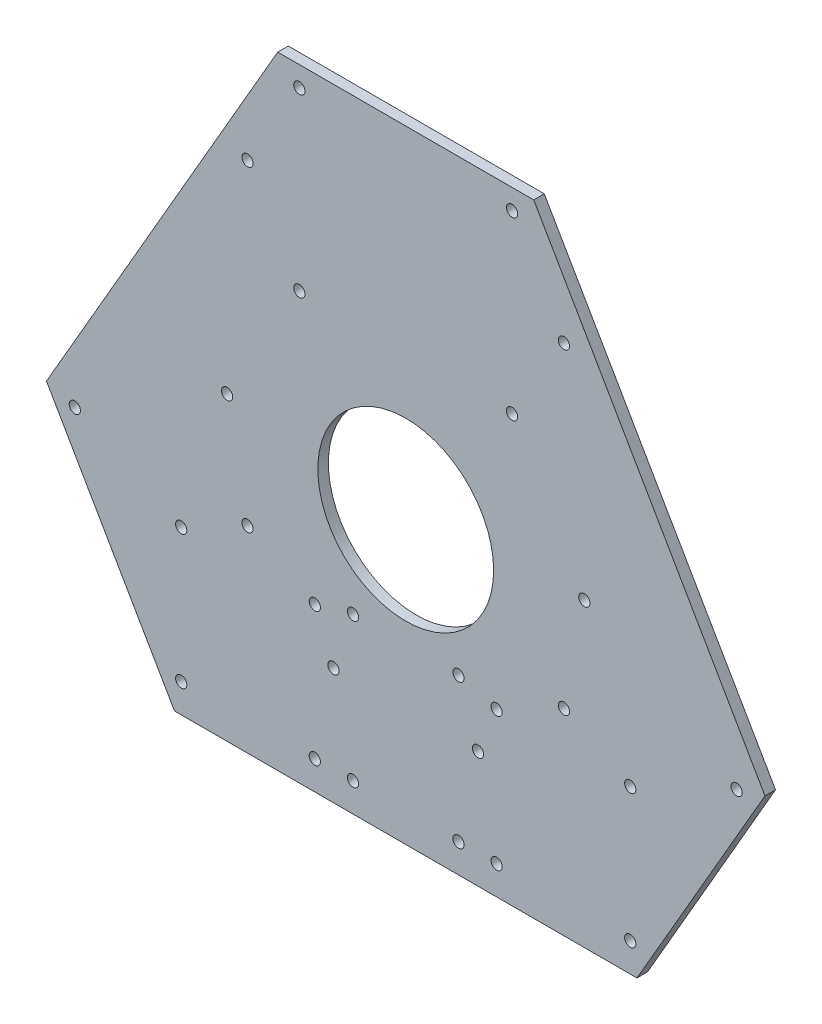
ISO-10303-21;
HEADER;
FILE_DESCRIPTION(('STEP AP214'),'2;1');
FILE_NAME('part.step','',(''),(''),'','','');
FILE_SCHEMA(('AUTOMOTIVE_DESIGN { 1 0 10303 214 1 1 1 1 }'));
ENDSEC;
DATA;
#1=APPLICATION_CONTEXT('core data for automotive mechanical design processes');
#2=APPLICATION_PROTOCOL_DEFINITION('international standard','automotive_design',2000,#1);
#3=PRODUCT_CONTEXT('',#1,'mechanical');
#4=PRODUCT('Part','Part','',(#3));
#5=PRODUCT_RELATED_PRODUCT_CATEGORY('part','',(#4));
#6=PRODUCT_DEFINITION_FORMATION('','',#4);
#7=PRODUCT_DEFINITION_CONTEXT('part definition',#1,'design');
#8=PRODUCT_DEFINITION('design','',#6,#7);
#9=PRODUCT_DEFINITION_SHAPE('','',#8);
#10=(LENGTH_UNIT() NAMED_UNIT(*) SI_UNIT(.MILLI.,.METRE.));
#11=(NAMED_UNIT(*) PLANE_ANGLE_UNIT() SI_UNIT($,.RADIAN.));
#12=(NAMED_UNIT(*) SI_UNIT($,.STERADIAN.) SOLID_ANGLE_UNIT());
#13=UNCERTAINTY_MEASURE_WITH_UNIT(LENGTH_MEASURE(1.E-05),#10,'distance_accuracy_value','');
#14=(GEOMETRIC_REPRESENTATION_CONTEXT(3) GLOBAL_UNCERTAINTY_ASSIGNED_CONTEXT((#13)) GLOBAL_UNIT_ASSIGNED_CONTEXT((#10,
#11,#12)) REPRESENTATION_CONTEXT('',''));
#15=CARTESIAN_POINT('',(0.,0.,0.));
#16=DIRECTION('',(0.,0.,1.));
#17=DIRECTION('',(1.,0.,0.));
#18=AXIS2_PLACEMENT_3D('',#15,#16,#17);
#19=CARTESIAN_POINT('',(-69.2820323027551,40.,3.));
#20=DIRECTION('',(-0.866025403784439,0.5,0.));
#21=DIRECTION('',(-0.5,-0.866025403784439,0.));
#22=AXIS2_PLACEMENT_3D('',#19,#20,#21);
#23=PLANE('',#22);
#24=DIRECTION('',(0.5,0.866025403784439,0.));
#25=VECTOR('',#24,1.);
#26=CARTESIAN_POINT('',(-69.2820323027551,40.,0.));
#27=LINE('',#26,#25);
#28=CARTESIAN_POINT('',(-102.165272155241,-16.9554421419794,0.));
#29=VERTEX_POINT('',#28);
#30=CARTESIAN_POINT('',(-36.3987924502691,96.9554421419794,0.));
#31=VERTEX_POINT('',#30);
#32=EDGE_CURVE('E158',#29,#31,#27,.T.);
#33=ORIENTED_EDGE('',*,*,#32,.F.);
#34=DIRECTION('',(0.,0.,-1.));
#35=VECTOR('',#34,1.);
#36=CARTESIAN_POINT('',(-102.165272155241,-16.9554421419794,3.));
#37=LINE('',#36,#35);
#38=CARTESIAN_POINT('',(-102.165272155241,-16.9554421419794,3.));
#39=VERTEX_POINT('',#38);
#40=EDGE_CURVE('E11',#39,#29,#37,.T.);
#41=ORIENTED_EDGE('',*,*,#40,.F.);
#42=DIRECTION('',(0.5,0.866025403784439,0.));
#43=VECTOR('',#42,1.);
#44=CARTESIAN_POINT('',(-69.2820323027551,40.,3.));
#45=LINE('',#44,#43);
#46=CARTESIAN_POINT('',(-36.3987924502691,96.9554421419794,3.));
#47=VERTEX_POINT('',#46);
#48=EDGE_CURVE('E626',#39,#47,#45,.T.);
#49=ORIENTED_EDGE('',*,*,#48,.T.);
#50=DIRECTION('',(0.,0.,-1.));
#51=VECTOR('',#50,1.);
#52=CARTESIAN_POINT('',(-36.3987924502691,96.9554421419794,3.));
#53=LINE('',#52,#51);
#54=EDGE_CURVE('E52',#47,#31,#53,.T.);
#55=ORIENTED_EDGE('',*,*,#54,.T.);
#56=EDGE_LOOP('',(#33,#41,#49,#55));
#57=FACE_BOUND('',#56,.T.);
#58=ADVANCED_FACE('F35',(#57),#23,.T.);
#59=CARTESIAN_POINT('',(-83.9658759301065,-48.4777210709897,3.));
#60=DIRECTION('',(-0.866025403784439,-0.5,0.));
#61=DIRECTION('',(0.5,-0.866025403784439,0.));
#62=AXIS2_PLACEMENT_3D('',#59,#60,#61);
#63=PLANE('',#62);
#64=DIRECTION('',(-0.5,0.866025403784439,0.));
#65=VECTOR('',#64,1.);
#66=CARTESIAN_POINT('',(-83.9658759301065,-48.4777210709897,0.));
#67=LINE('',#66,#65);
#68=CARTESIAN_POINT('',(-65.766479704972,-80.,0.));
#69=VERTEX_POINT('',#68);
#70=EDGE_CURVE('E160',#69,#29,#67,.T.);
#71=ORIENTED_EDGE('',*,*,#70,.F.);
#72=DIRECTION('',(0.,0.,-1.));
#73=VECTOR('',#72,1.);
#74=CARTESIAN_POINT('',(-65.766479704972,-80.,3.));
#75=LINE('',#74,#73);
#76=CARTESIAN_POINT('',(-65.766479704972,-80.,3.));
#77=VERTEX_POINT('',#76);
#78=EDGE_CURVE('E44',#77,#69,#75,.T.);
#79=ORIENTED_EDGE('',*,*,#78,.F.);
#80=DIRECTION('',(-0.5,0.866025403784439,0.));
#81=VECTOR('',#80,1.);
#82=CARTESIAN_POINT('',(-83.9658759301065,-48.4777210709897,3.));
#83=LINE('',#82,#81);
#84=EDGE_CURVE('E628',#77,#39,#83,.T.);
#85=ORIENTED_EDGE('',*,*,#84,.T.);
#86=ORIENTED_EDGE('',*,*,#40,.T.);
#87=EDGE_LOOP('',(#71,#79,#85,#86));
#88=FACE_BOUND('',#87,.T.);
#89=ADVANCED_FACE('F190',(#88),#63,.T.);
#90=CARTESIAN_POINT('',(0.,-80.,3.));
#91=DIRECTION('',(0.,-1.,0.));
#92=DIRECTION('',(1.,0.,0.));
#93=AXIS2_PLACEMENT_3D('',#90,#91,#92);
#94=PLANE('',#93);
#95=DIRECTION('',(-1.,0.,0.));
#96=VECTOR('',#95,1.);
#97=CARTESIAN_POINT('',(0.,-80.,0.));
#98=LINE('',#97,#96);
#99=CARTESIAN_POINT('',(65.766479704972,-80.,0.));
#100=VERTEX_POINT('',#99);
#101=EDGE_CURVE('E163',#100,#69,#98,.T.);
#102=ORIENTED_EDGE('',*,*,#101,.F.);
#103=DIRECTION('',(0.,0.,-1.));
#104=VECTOR('',#103,1.);
#105=CARTESIAN_POINT('',(65.766479704972,-80.,3.));
#106=LINE('',#105,#104);
#107=CARTESIAN_POINT('',(65.766479704972,-80.,3.));
#108=VERTEX_POINT('',#107);
#109=EDGE_CURVE('E99',#108,#100,#106,.T.);
#110=ORIENTED_EDGE('',*,*,#109,.F.);
#111=DIRECTION('',(-1.,0.,0.));
#112=VECTOR('',#111,1.);
#113=CARTESIAN_POINT('',(0.,-80.,3.));
#114=LINE('',#113,#112);
#115=EDGE_CURVE('E110',#108,#77,#114,.T.);
#116=ORIENTED_EDGE('',*,*,#115,.T.);
#117=ORIENTED_EDGE('',*,*,#78,.T.);
#118=EDGE_LOOP('',(#102,#110,#116,#117));
#119=FACE_BOUND('',#118,.T.);
#120=ADVANCED_FACE('F187',(#119),#94,.T.);
#121=CARTESIAN_POINT('',(83.9658759301065,-48.4777210709897,3.));
#122=DIRECTION('',(0.866025403784439,-0.5,0.));
#123=DIRECTION('',(0.5,0.866025403784439,0.));
#124=AXIS2_PLACEMENT_3D('',#121,#122,#123);
#125=PLANE('',#124);
#126=DIRECTION('',(-0.5,-0.866025403784439,0.));
#127=VECTOR('',#126,1.);
#128=CARTESIAN_POINT('',(83.9658759301065,-48.4777210709897,0.));
#129=LINE('',#128,#127);
#130=CARTESIAN_POINT('',(102.165272155241,-16.9554421419794,0.));
#131=VERTEX_POINT('',#130);
#132=EDGE_CURVE('E95',#131,#100,#129,.T.);
#133=ORIENTED_EDGE('',*,*,#132,.F.);
#134=DIRECTION('',(0.,0.,-1.));
#135=VECTOR('',#134,1.);
#136=CARTESIAN_POINT('',(102.165272155241,-16.9554421419794,3.));
#137=LINE('',#136,#135);
#138=CARTESIAN_POINT('',(102.165272155241,-16.9554421419794,3.));
#139=VERTEX_POINT('',#138);
#140=EDGE_CURVE('E90',#139,#131,#137,.T.);
#141=ORIENTED_EDGE('',*,*,#140,.F.);
#142=DIRECTION('',(-0.5,-0.866025403784439,0.));
#143=VECTOR('',#142,1.);
#144=CARTESIAN_POINT('',(83.9658759301065,-48.4777210709897,3.));
#145=LINE('',#144,#143);
#146=EDGE_CURVE('E93',#139,#108,#145,.T.);
#147=ORIENTED_EDGE('',*,*,#146,.T.);
#148=ORIENTED_EDGE('',*,*,#109,.T.);
#149=EDGE_LOOP('',(#133,#141,#147,#148));
#150=FACE_BOUND('',#149,.T.);
#151=ADVANCED_FACE('F92',(#150),#125,.T.);
#152=CARTESIAN_POINT('',(69.2820323027551,40.,3.));
#153=DIRECTION('',(0.866025403784438,0.5,0.));
#154=DIRECTION('',(-0.5,0.866025403784439,0.));
#155=AXIS2_PLACEMENT_3D('',#152,#153,#154);
#156=PLANE('',#155);
#157=DIRECTION('',(0.5,-0.866025403784438,0.));
#158=VECTOR('',#157,1.);
#159=CARTESIAN_POINT('',(69.2820323027551,40.,0.));
#160=LINE('',#159,#158);
#161=CARTESIAN_POINT('',(36.3987924502691,96.9554421419794,0.));
#162=VERTEX_POINT('',#161);
#163=EDGE_CURVE('E167',#162,#131,#160,.T.);
#164=ORIENTED_EDGE('',*,*,#163,.F.);
#165=DIRECTION('',(0.,0.,-1.));
#166=VECTOR('',#165,1.);
#167=CARTESIAN_POINT('',(36.3987924502691,96.9554421419794,3.));
#168=LINE('',#167,#166);
#169=CARTESIAN_POINT('',(36.3987924502691,96.9554421419794,3.));
#170=VERTEX_POINT('',#169);
#171=EDGE_CURVE('E71',#170,#162,#168,.T.);
#172=ORIENTED_EDGE('',*,*,#171,.F.);
#173=DIRECTION('',(0.5,-0.866025403784438,0.));
#174=VECTOR('',#173,1.);
#175=CARTESIAN_POINT('',(69.2820323027551,40.,3.));
#176=LINE('',#175,#174);
#177=EDGE_CURVE('E107',#170,#139,#176,.T.);
#178=ORIENTED_EDGE('',*,*,#177,.T.);
#179=ORIENTED_EDGE('',*,*,#140,.T.);
#180=EDGE_LOOP('',(#164,#172,#178,#179));
#181=FACE_BOUND('',#180,.T.);
#182=ADVANCED_FACE('F112',(#181),#156,.T.);
#183=CARTESIAN_POINT('',(50.8013479245526,5.59951938653611,3.));
#184=DIRECTION('',(0.,0.,-1.));
#185=DIRECTION('',(-1.,0.,0.));
#186=AXIS2_PLACEMENT_3D('',#183,#184,#185);
#187=CYLINDRICAL_SURFACE('',#186,1.60000000000002);
#188=CARTESIAN_POINT('',(50.8013479245526,5.59951938653611,3.));
#189=DIRECTION('',(0.,0.,1.));
#190=DIRECTION('',(1.,0.,0.));
#191=AXIS2_PLACEMENT_3D('',#188,#189,#190);
#192=CIRCLE('',#191,1.60000000000002);
#193=CARTESIAN_POINT('',(52.4013479245526,5.59951938653611,3.));
#194=VERTEX_POINT('',#193);
#195=EDGE_CURVE('E121',#194,#194,#192,.F.);
#196=ORIENTED_EDGE('',*,*,#195,.F.);
#197=EDGE_LOOP('',(#196));
#198=FACE_BOUND('',#197,.T.);
#199=CARTESIAN_POINT('',(50.8013479245526,5.59951938653611,0.));
#200=DIRECTION('',(0.,0.,1.));
#201=DIRECTION('',(1.,0.,0.));
#202=AXIS2_PLACEMENT_3D('',#199,#200,#201);
#203=CIRCLE('',#202,1.60000000000002);
#204=CARTESIAN_POINT('',(52.4013479245526,5.59951938653611,0.));
#205=VERTEX_POINT('',#204);
#206=EDGE_CURVE('E175',#205,#205,#203,.F.);
#207=ORIENTED_EDGE('',*,*,#206,.T.);
#208=EDGE_LOOP('',(#207));
#209=FACE_BOUND('',#208,.T.);
#210=ADVANCED_FACE('F206',(#198,#209),#187,.F.);
#211=CARTESIAN_POINT('',(-30.25,91.1954981558864,3.));
#212=DIRECTION('',(0.,0.,-1.));
#213=DIRECTION('',(-1.,0.,0.));
#214=AXIS2_PLACEMENT_3D('',#211,#212,#213);
#215=CYLINDRICAL_SURFACE('',#214,1.60000000000001);
#216=CARTESIAN_POINT('',(-30.25,91.1954981558864,3.));
#217=DIRECTION('',(0.,0.,1.));
#218=DIRECTION('',(1.,0.,0.));
#219=AXIS2_PLACEMENT_3D('',#216,#217,#218);
#220=CIRCLE('',#219,1.60000000000001);
#221=CARTESIAN_POINT('',(-28.65,91.1954981558864,3.));
#222=VERTEX_POINT('',#221);
#223=EDGE_CURVE('E115',#222,#222,#220,.F.);
#224=ORIENTED_EDGE('',*,*,#223,.F.);
#225=EDGE_LOOP('',(#224));
#226=FACE_BOUND('',#225,.T.);
#227=CARTESIAN_POINT('',(-30.25,91.1954981558864,0.));
#228=DIRECTION('',(0.,0.,1.));
#229=DIRECTION('',(1.,0.,0.));
#230=AXIS2_PLACEMENT_3D('',#227,#228,#229);
#231=CIRCLE('',#230,1.60000000000001);
#232=CARTESIAN_POINT('',(-28.65,91.1954981558864,0.));
#233=VERTEX_POINT('',#232);
#234=EDGE_CURVE('E172',#233,#233,#231,.F.);
#235=ORIENTED_EDGE('',*,*,#234,.T.);
#236=EDGE_LOOP('',(#235));
#237=FACE_BOUND('',#236,.T.);
#238=ADVANCED_FACE('F197',(#226,#237),#215,.F.);
#239=CARTESIAN_POINT('',(0.,96.9554421419794,3.));
#240=DIRECTION('',(0.,1.,0.));
#241=DIRECTION('',(0.,0.,1.));
#242=AXIS2_PLACEMENT_3D('',#239,#240,#241);
#243=PLANE('',#242);
#244=DIRECTION('',(1.,0.,0.));
#245=VECTOR('',#244,1.);
#246=CARTESIAN_POINT('',(0.,96.9554421419794,0.));
#247=LINE('',#246,#245);
#248=EDGE_CURVE('E169',#31,#162,#247,.T.);
#249=ORIENTED_EDGE('',*,*,#248,.F.);
#250=ORIENTED_EDGE('',*,*,#54,.F.);
#251=DIRECTION('',(1.,0.,0.));
#252=VECTOR('',#251,1.);
#253=CARTESIAN_POINT('',(0.,96.9554421419794,3.));
#254=LINE('',#253,#252);
#255=EDGE_CURVE('E113',#47,#170,#254,.T.);
#256=ORIENTED_EDGE('',*,*,#255,.T.);
#257=ORIENTED_EDGE('',*,*,#171,.T.);
#258=EDGE_LOOP('',(#249,#250,#256,#257));
#259=FACE_BOUND('',#258,.T.);
#260=ADVANCED_FACE('F194',(#259),#243,.T.);
#261=CARTESIAN_POINT('',(30.25,91.1954981558864,3.));
#262=DIRECTION('',(0.,0.,-1.));
#263=DIRECTION('',(-1.,0.,0.));
#264=AXIS2_PLACEMENT_3D('',#261,#262,#263);
#265=CYLINDRICAL_SURFACE('',#264,1.60000000000004);
#266=CARTESIAN_POINT('',(30.25,91.1954981558864,3.));
#267=DIRECTION('',(0.,0.,1.));
#268=DIRECTION('',(1.,0.,0.));
#269=AXIS2_PLACEMENT_3D('',#266,#267,#268);
#270=CIRCLE('',#269,1.60000000000004);
#271=CARTESIAN_POINT('',(31.8500000000001,91.1954981558864,3.));
#272=VERTEX_POINT('',#271);
#273=EDGE_CURVE('E623',#272,#272,#270,.T.);
#274=ORIENTED_EDGE('',*,*,#273,.T.);
#275=EDGE_LOOP('',(#274));
#276=FACE_BOUND('',#275,.T.);
#277=CARTESIAN_POINT('',(30.25,91.1954981558864,0.));
#278=DIRECTION('',(0.,0.,1.));
#279=DIRECTION('',(1.,0.,0.));
#280=AXIS2_PLACEMENT_3D('',#277,#278,#279);
#281=CIRCLE('',#280,1.60000000000004);
#282=CARTESIAN_POINT('',(31.8500000000001,91.1954981558864,0.));
#283=VERTEX_POINT('',#282);
#284=EDGE_CURVE('E155',#283,#283,#281,.T.);
#285=ORIENTED_EDGE('',*,*,#284,.F.);
#286=EDGE_LOOP('',(#285));
#287=FACE_BOUND('',#286,.T.);
#288=ADVANCED_FACE('F196',(#276,#287),#265,.F.);
#289=CARTESIAN_POINT('',(30.25,41.1954981558864,3.));
#290=DIRECTION('',(0.,0.,-1.));
#291=DIRECTION('',(-1.,0.,0.));
#292=AXIS2_PLACEMENT_3D('',#289,#290,#291);
#293=CYLINDRICAL_SURFACE('',#292,1.60000000000004);
#294=CARTESIAN_POINT('',(30.25,41.1954981558864,3.));
#295=DIRECTION('',(0.,0.,1.));
#296=DIRECTION('',(1.,0.,0.));
#297=AXIS2_PLACEMENT_3D('',#294,#295,#296);
#298=CIRCLE('',#297,1.60000000000004);
#299=CARTESIAN_POINT('',(31.8500000000001,41.1954981558864,3.));
#300=VERTEX_POINT('',#299);
#301=EDGE_CURVE('E620',#300,#300,#298,.T.);
#302=ORIENTED_EDGE('',*,*,#301,.T.);
#303=EDGE_LOOP('',(#302));
#304=FACE_BOUND('',#303,.T.);
#305=CARTESIAN_POINT('',(30.25,41.1954981558864,0.));
#306=DIRECTION('',(0.,0.,1.));
#307=DIRECTION('',(1.,0.,0.));
#308=AXIS2_PLACEMENT_3D('',#305,#306,#307);
#309=CIRCLE('',#308,1.60000000000004);
#310=CARTESIAN_POINT('',(31.8500000000001,41.1954981558864,0.));
#311=VERTEX_POINT('',#310);
#312=EDGE_CURVE('E152',#311,#311,#309,.T.);
#313=ORIENTED_EDGE('',*,*,#312,.F.);
#314=EDGE_LOOP('',(#313));
#315=FACE_BOUND('',#314,.T.);
#316=ADVANCED_FACE('F203',(#304,#315),#293,.F.);
#317=CARTESIAN_POINT('',(-30.25,41.1954981558863,3.));
#318=DIRECTION('',(0.,0.,-1.));
#319=DIRECTION('',(-1.,0.,0.));
#320=AXIS2_PLACEMENT_3D('',#317,#318,#319);
#321=CYLINDRICAL_SURFACE('',#320,1.60000000000001);
#322=CARTESIAN_POINT('',(-30.25,41.1954981558863,3.));
#323=DIRECTION('',(0.,0.,1.));
#324=DIRECTION('',(1.,0.,0.));
#325=AXIS2_PLACEMENT_3D('',#322,#323,#324);
#326=CIRCLE('',#325,1.60000000000001);
#327=CARTESIAN_POINT('',(-28.65,41.1954981558863,3.));
#328=VERTEX_POINT('',#327);
#329=EDGE_CURVE('E617',#328,#328,#326,.F.);
#330=ORIENTED_EDGE('',*,*,#329,.F.);
#331=EDGE_LOOP('',(#330));
#332=FACE_BOUND('',#331,.T.);
#333=CARTESIAN_POINT('',(-30.25,41.1954981558863,0.));
#334=DIRECTION('',(0.,0.,1.));
#335=DIRECTION('',(1.,0.,0.));
#336=AXIS2_PLACEMENT_3D('',#333,#334,#335);
#337=CIRCLE('',#336,1.60000000000001);
#338=CARTESIAN_POINT('',(-28.65,41.1954981558863,0.));
#339=VERTEX_POINT('',#338);
#340=EDGE_CURVE('E149',#339,#339,#337,.F.);
#341=ORIENTED_EDGE('',*,*,#340,.T.);
#342=EDGE_LOOP('',(#341));
#343=FACE_BOUND('',#342,.T.);
#344=ADVANCED_FACE('F220',(#332,#343),#321,.F.);
#345=CARTESIAN_POINT('',(63.8526181137746,-71.7950175424225,3.));
#346=DIRECTION('',(0.,0.,-1.));
#347=DIRECTION('',(-1.,0.,0.));
#348=AXIS2_PLACEMENT_3D('',#345,#346,#347);
#349=CYLINDRICAL_SURFACE('',#348,1.60000000000002);
#350=CARTESIAN_POINT('',(63.8526181137746,-71.7950175424225,3.));
#351=DIRECTION('',(0.,0.,1.));
#352=DIRECTION('',(1.,0.,0.));
#353=AXIS2_PLACEMENT_3D('',#350,#351,#352);
#354=CIRCLE('',#353,1.60000000000002);
#355=CARTESIAN_POINT('',(65.4526181137746,-71.7950175424225,3.));
#356=VERTEX_POINT('',#355);
#357=EDGE_CURVE('E614',#356,#356,#354,.T.);
#358=ORIENTED_EDGE('',*,*,#357,.T.);
#359=EDGE_LOOP('',(#358));
#360=FACE_BOUND('',#359,.T.);
#361=CARTESIAN_POINT('',(63.8526181137746,-71.7950175424225,0.));
#362=DIRECTION('',(0.,0.,1.));
#363=DIRECTION('',(1.,0.,0.));
#364=AXIS2_PLACEMENT_3D('',#361,#362,#363);
#365=CIRCLE('',#364,1.60000000000002);
#366=CARTESIAN_POINT('',(65.4526181137746,-71.7950175424225,0.));
#367=VERTEX_POINT('',#366);
#368=EDGE_CURVE('E146',#367,#367,#365,.T.);
#369=ORIENTED_EDGE('',*,*,#368,.F.);
#370=EDGE_LOOP('',(#369));
#371=FACE_BOUND('',#370,.T.);
#372=ADVANCED_FACE('F224',(#360,#371),#349,.F.);
#373=CARTESIAN_POINT('',(94.1026181137746,-19.4004806134639,3.));
#374=DIRECTION('',(0.,0.,-1.));
#375=DIRECTION('',(-1.,0.,0.));
#376=AXIS2_PLACEMENT_3D('',#373,#374,#375);
#377=CYLINDRICAL_SURFACE('',#376,1.60000000000002);
#378=CARTESIAN_POINT('',(94.1026181137746,-19.4004806134639,3.));
#379=DIRECTION('',(0.,0.,1.));
#380=DIRECTION('',(1.,0.,0.));
#381=AXIS2_PLACEMENT_3D('',#378,#379,#380);
#382=CIRCLE('',#381,1.60000000000002);
#383=CARTESIAN_POINT('',(95.7026181137746,-19.4004806134639,3.));
#384=VERTEX_POINT('',#383);
#385=EDGE_CURVE('E611',#384,#384,#382,.F.);
#386=ORIENTED_EDGE('',*,*,#385,.F.);
#387=EDGE_LOOP('',(#386));
#388=FACE_BOUND('',#387,.T.);
#389=CARTESIAN_POINT('',(94.1026181137746,-19.4004806134639,0.));
#390=DIRECTION('',(0.,0.,1.));
#391=DIRECTION('',(1.,0.,0.));
#392=AXIS2_PLACEMENT_3D('',#389,#390,#391);
#393=CIRCLE('',#392,1.60000000000002);
#394=CARTESIAN_POINT('',(95.7026181137746,-19.4004806134639,0.));
#395=VERTEX_POINT('',#394);
#396=EDGE_CURVE('E143',#395,#395,#393,.F.);
#397=ORIENTED_EDGE('',*,*,#396,.T.);
#398=EDGE_LOOP('',(#397));
#399=FACE_BOUND('',#398,.T.);
#400=ADVANCED_FACE('F228',(#388,#399),#377,.F.);
#401=CARTESIAN_POINT('',(20.5513479245526,-46.7950175424225,3.));
#402=DIRECTION('',(0.,0.,-1.));
#403=DIRECTION('',(-1.,0.,0.));
#404=AXIS2_PLACEMENT_3D('',#401,#402,#403);
#405=CYLINDRICAL_SURFACE('',#404,1.60000000000002);
#406=CARTESIAN_POINT('',(20.5513479245526,-46.7950175424225,3.));
#407=DIRECTION('',(0.,0.,1.));
#408=DIRECTION('',(1.,0.,0.));
#409=AXIS2_PLACEMENT_3D('',#406,#407,#408);
#410=CIRCLE('',#409,1.60000000000002);
#411=CARTESIAN_POINT('',(22.1513479245526,-46.7950175424225,3.));
#412=VERTEX_POINT('',#411);
#413=EDGE_CURVE('E608',#412,#412,#410,.T.);
#414=ORIENTED_EDGE('',*,*,#413,.T.);
#415=EDGE_LOOP('',(#414));
#416=FACE_BOUND('',#415,.T.);
#417=CARTESIAN_POINT('',(20.5513479245526,-46.7950175424225,0.));
#418=DIRECTION('',(0.,0.,1.));
#419=DIRECTION('',(1.,0.,0.));
#420=AXIS2_PLACEMENT_3D('',#417,#418,#419);
#421=CIRCLE('',#420,1.60000000000002);
#422=CARTESIAN_POINT('',(22.1513479245526,-46.7950175424225,0.));
#423=VERTEX_POINT('',#422);
#424=EDGE_CURVE('E140',#423,#423,#421,.T.);
#425=ORIENTED_EDGE('',*,*,#424,.F.);
#426=EDGE_LOOP('',(#425));
#427=FACE_BOUND('',#426,.T.);
#428=ADVANCED_FACE('F232',(#416,#427),#405,.F.);
#429=CARTESIAN_POINT('',(-94.1026181137746,-19.400480613464,3.));
#430=DIRECTION('',(0.,0.,-1.));
#431=DIRECTION('',(-1.,0.,0.));
#432=AXIS2_PLACEMENT_3D('',#429,#430,#431);
#433=CYLINDRICAL_SURFACE('',#432,1.60000000000002);
#434=CARTESIAN_POINT('',(-94.1026181137746,-19.400480613464,3.));
#435=DIRECTION('',(0.,0.,1.));
#436=DIRECTION('',(1.,0.,0.));
#437=AXIS2_PLACEMENT_3D('',#434,#435,#436);
#438=CIRCLE('',#437,1.60000000000002);
#439=CARTESIAN_POINT('',(-92.5026181137745,-19.400480613464,3.));
#440=VERTEX_POINT('',#439);
#441=EDGE_CURVE('E605',#440,#440,#438,.T.);
#442=ORIENTED_EDGE('',*,*,#441,.T.);
#443=EDGE_LOOP('',(#442));
#444=FACE_BOUND('',#443,.T.);
#445=CARTESIAN_POINT('',(-94.1026181137746,-19.400480613464,0.));
#446=DIRECTION('',(0.,0.,1.));
#447=DIRECTION('',(1.,0.,0.));
#448=AXIS2_PLACEMENT_3D('',#445,#446,#447);
#449=CIRCLE('',#448,1.60000000000002);
#450=CARTESIAN_POINT('',(-92.5026181137745,-19.400480613464,0.));
#451=VERTEX_POINT('',#450);
#452=EDGE_CURVE('E137',#451,#451,#449,.T.);
#453=ORIENTED_EDGE('',*,*,#452,.F.);
#454=EDGE_LOOP('',(#453));
#455=FACE_BOUND('',#454,.T.);
#456=ADVANCED_FACE('F236',(#444,#455),#433,.F.);
#457=CARTESIAN_POINT('',(-63.8526181137745,-71.7950175424225,3.));
#458=DIRECTION('',(0.,0.,-1.));
#459=DIRECTION('',(-1.,0.,0.));
#460=AXIS2_PLACEMENT_3D('',#457,#458,#459);
#461=CYLINDRICAL_SURFACE('',#460,1.60000000000001);
#462=CARTESIAN_POINT('',(-63.8526181137745,-71.7950175424225,3.));
#463=DIRECTION('',(0.,0.,1.));
#464=DIRECTION('',(1.,0.,0.));
#465=AXIS2_PLACEMENT_3D('',#462,#463,#464);
#466=CIRCLE('',#465,1.60000000000001);
#467=CARTESIAN_POINT('',(-62.2526181137745,-71.7950175424225,3.));
#468=VERTEX_POINT('',#467);
#469=EDGE_CURVE('E602',#468,#468,#466,.F.);
#470=ORIENTED_EDGE('',*,*,#469,.F.);
#471=EDGE_LOOP('',(#470));
#472=FACE_BOUND('',#471,.T.);
#473=CARTESIAN_POINT('',(-63.8526181137745,-71.7950175424225,0.));
#474=DIRECTION('',(0.,0.,1.));
#475=DIRECTION('',(1.,0.,0.));
#476=AXIS2_PLACEMENT_3D('',#473,#474,#475);
#477=CIRCLE('',#476,1.60000000000001);
#478=CARTESIAN_POINT('',(-62.2526181137745,-71.7950175424225,0.));
#479=VERTEX_POINT('',#478);
#480=EDGE_CURVE('E134',#479,#479,#477,.F.);
#481=ORIENTED_EDGE('',*,*,#480,.T.);
#482=EDGE_LOOP('',(#481));
#483=FACE_BOUND('',#482,.T.);
#484=ADVANCED_FACE('F240',(#472,#483),#461,.F.);
#485=CARTESIAN_POINT('',(-50.8013479245526,5.59951938653608,3.));
#486=DIRECTION('',(0.,0.,-1.));
#487=DIRECTION('',(-1.,0.,0.));
#488=AXIS2_PLACEMENT_3D('',#485,#486,#487);
#489=CYLINDRICAL_SURFACE('',#488,1.60000000000002);
#490=CARTESIAN_POINT('',(-50.8013479245526,5.59951938653608,3.));
#491=DIRECTION('',(0.,0.,1.));
#492=DIRECTION('',(1.,0.,0.));
#493=AXIS2_PLACEMENT_3D('',#490,#491,#492);
#494=CIRCLE('',#493,1.60000000000002);
#495=CARTESIAN_POINT('',(-49.2013479245526,5.59951938653608,3.));
#496=VERTEX_POINT('',#495);
#497=EDGE_CURVE('E255',#496,#496,#494,.T.);
#498=ORIENTED_EDGE('',*,*,#497,.T.);
#499=EDGE_LOOP('',(#498));
#500=FACE_BOUND('',#499,.T.);
#501=CARTESIAN_POINT('',(-50.8013479245526,5.59951938653608,0.));
#502=DIRECTION('',(0.,0.,1.));
#503=DIRECTION('',(1.,0.,0.));
#504=AXIS2_PLACEMENT_3D('',#501,#502,#503);
#505=CIRCLE('',#504,1.60000000000002);
#506=CARTESIAN_POINT('',(-49.2013479245526,5.59951938653608,0.));
#507=VERTEX_POINT('',#506);
#508=EDGE_CURVE('E130',#507,#507,#505,.T.);
#509=ORIENTED_EDGE('',*,*,#508,.F.);
#510=EDGE_LOOP('',(#509));
#511=FACE_BOUND('',#510,.T.);
#512=ADVANCED_FACE('F243',(#500,#511),#489,.F.);
#513=CARTESIAN_POINT('',(0.,0.,3.));
#514=DIRECTION('',(0.,0.,-1.));
#515=DIRECTION('',(-1.,0.,0.));
#516=AXIS2_PLACEMENT_3D('',#513,#514,#515);
#517=CYLINDRICAL_SURFACE('',#516,25.);
#518=CARTESIAN_POINT('',(0.,0.,3.));
#519=DIRECTION('',(0.,0.,1.));
#520=DIRECTION('',(1.,0.,0.));
#521=AXIS2_PLACEMENT_3D('',#518,#519,#520);
#522=CIRCLE('',#521,25.);
#523=CARTESIAN_POINT('',(25.,0.,3.));
#524=VERTEX_POINT('',#523);
#525=EDGE_CURVE('E181',#524,#524,#522,.T.);
#526=ORIENTED_EDGE('',*,*,#525,.T.);
#527=EDGE_LOOP('',(#526));
#528=FACE_BOUND('',#527,.T.);
#529=CARTESIAN_POINT('',(0.,0.,0.));
#530=DIRECTION('',(0.,0.,1.));
#531=DIRECTION('',(1.,0.,0.));
#532=AXIS2_PLACEMENT_3D('',#529,#530,#531);
#533=CIRCLE('',#532,25.);
#534=CARTESIAN_POINT('',(25.,0.,0.));
#535=VERTEX_POINT('',#534);
#536=EDGE_CURVE('E127',#535,#535,#533,.T.);
#537=ORIENTED_EDGE('',*,*,#536,.F.);
#538=EDGE_LOOP('',(#537));
#539=FACE_BOUND('',#538,.T.);
#540=ADVANCED_FACE('F37',(#528,#539),#517,.F.);
#541=CARTESIAN_POINT('',(-20.5513479245526,-46.7950175424225,3.));
#542=DIRECTION('',(0.,0.,-1.));
#543=DIRECTION('',(-1.,0.,0.));
#544=AXIS2_PLACEMENT_3D('',#541,#542,#543);
#545=CYLINDRICAL_SURFACE('',#544,1.60000000000002);
#546=CARTESIAN_POINT('',(-20.5513479245526,-46.7950175424225,3.));
#547=DIRECTION('',(0.,0.,1.));
#548=DIRECTION('',(1.,0.,0.));
#549=AXIS2_PLACEMENT_3D('',#546,#547,#548);
#550=CIRCLE('',#549,1.60000000000002);
#551=CARTESIAN_POINT('',(-18.9513479245525,-46.7950175424225,3.));
#552=VERTEX_POINT('',#551);
#553=EDGE_CURVE('E124',#552,#552,#550,.F.);
#554=ORIENTED_EDGE('',*,*,#553,.F.);
#555=EDGE_LOOP('',(#554));
#556=FACE_BOUND('',#555,.T.);
#557=CARTESIAN_POINT('',(-20.5513479245526,-46.7950175424225,0.));
#558=DIRECTION('',(0.,0.,1.));
#559=DIRECTION('',(1.,0.,0.));
#560=AXIS2_PLACEMENT_3D('',#557,#558,#559);
#561=CIRCLE('',#560,1.60000000000002);
#562=CARTESIAN_POINT('',(-18.9513479245525,-46.7950175424225,0.));
#563=VERTEX_POINT('',#562);
#564=EDGE_CURVE('E178',#563,#563,#561,.F.);
#565=ORIENTED_EDGE('',*,*,#564,.T.);
#566=EDGE_LOOP('',(#565));
#567=FACE_BOUND('',#566,.T.);
#568=ADVANCED_FACE('F250',(#556,#567),#545,.F.);
#569=CARTESIAN_POINT('',(0.,0.,3.));
#570=DIRECTION('',(0.,0.,1.));
#571=DIRECTION('',(1.,0.,0.));
#572=AXIS2_PLACEMENT_3D('',#569,#570,#571);
#573=PLANE('',#572);
#574=CARTESIAN_POINT('',(-45.,66.,3.));
#575=DIRECTION('',(0.,0.,-1.));
#576=DIRECTION('',(-1.,0.,0.));
#577=AXIS2_PLACEMENT_3D('',#574,#575,#576);
#578=CIRCLE('',#577,1.59999999999999);
#579=CARTESIAN_POINT('',(-46.6,66.,3.));
#580=VERTEX_POINT('',#579);
#581=EDGE_CURVE('E563',#580,#580,#578,.T.);
#582=ORIENTED_EDGE('',*,*,#581,.T.);
#583=EDGE_LOOP('',(#582));
#584=FACE_BOUND('',#583,.T.);
#585=CARTESIAN_POINT('',(-15.,-71.7950175424225,3.));
#586=DIRECTION('',(0.,0.,-1.));
#587=DIRECTION('',(-1.,0.,0.));
#588=AXIS2_PLACEMENT_3D('',#585,#586,#587);
#589=CIRCLE('',#588,1.6);
#590=CARTESIAN_POINT('',(-16.6,-71.7950175424225,3.));
#591=VERTEX_POINT('',#590);
#592=EDGE_CURVE('E708',#591,#591,#589,.T.);
#593=ORIENTED_EDGE('',*,*,#592,.T.);
#594=EDGE_LOOP('',(#593));
#595=FACE_BOUND('',#594,.T.);
#596=CARTESIAN_POINT('',(15.,-71.7950175424225,3.));
#597=DIRECTION('',(0.,0.,-1.));
#598=DIRECTION('',(-1.,0.,0.));
#599=AXIS2_PLACEMENT_3D('',#596,#597,#598);
#600=CIRCLE('',#599,1.6);
#601=CARTESIAN_POINT('',(13.4,-71.7950175424225,3.));
#602=VERTEX_POINT('',#601);
#603=EDGE_CURVE('E702',#602,#602,#600,.T.);
#604=ORIENTED_EDGE('',*,*,#603,.T.);
#605=EDGE_LOOP('',(#604));
#606=FACE_BOUND('',#605,.T.);
#607=CARTESIAN_POINT('',(15.,-30.7950175424225,3.));
#608=DIRECTION('',(0.,0.,-1.));
#609=DIRECTION('',(-1.,0.,0.));
#610=AXIS2_PLACEMENT_3D('',#607,#608,#609);
#611=CIRCLE('',#610,1.59999999999999);
#612=CARTESIAN_POINT('',(13.4,-30.7950175424225,3.));
#613=VERTEX_POINT('',#612);
#614=EDGE_CURVE('E582',#613,#613,#611,.T.);
#615=ORIENTED_EDGE('',*,*,#614,.T.);
#616=EDGE_LOOP('',(#615));
#617=FACE_BOUND('',#616,.T.);
#618=CARTESIAN_POINT('',(25.8526181137746,-33.7950175424225,3.));
#619=DIRECTION('',(0.,0.,-1.));
#620=DIRECTION('',(-1.,0.,0.));
#621=AXIS2_PLACEMENT_3D('',#618,#619,#620);
#622=CIRCLE('',#621,1.59999999999996);
#623=CARTESIAN_POINT('',(24.2526181137746,-33.7950175424225,3.));
#624=VERTEX_POINT('',#623);
#625=EDGE_CURVE('E583',#624,#624,#622,.T.);
#626=ORIENTED_EDGE('',*,*,#625,.T.);
#627=EDGE_LOOP('',(#626));
#628=FACE_BOUND('',#627,.T.);
#629=CARTESIAN_POINT('',(25.8526181137746,-71.7950175424225,3.));
#630=DIRECTION('',(0.,0.,-1.));
#631=DIRECTION('',(-1.,0.,0.));
#632=AXIS2_PLACEMENT_3D('',#629,#630,#631);
#633=CIRCLE('',#632,1.59999999999996);
#634=CARTESIAN_POINT('',(24.2526181137746,-71.7950175424225,3.));
#635=VERTEX_POINT('',#634);
#636=EDGE_CURVE('E590',#635,#635,#633,.T.);
#637=ORIENTED_EDGE('',*,*,#636,.T.);
#638=EDGE_LOOP('',(#637));
#639=FACE_BOUND('',#638,.T.);
#640=CARTESIAN_POINT('',(-15.,-30.7950175424225,3.));
#641=DIRECTION('',(0.,0.,-1.));
#642=DIRECTION('',(-1.,0.,0.));
#643=AXIS2_PLACEMENT_3D('',#640,#641,#642);
#644=CIRCLE('',#643,1.59999999999999);
#645=CARTESIAN_POINT('',(-16.6,-30.7950175424225,3.));
#646=VERTEX_POINT('',#645);
#647=EDGE_CURVE('E575',#646,#646,#644,.T.);
#648=ORIENTED_EDGE('',*,*,#647,.T.);
#649=EDGE_LOOP('',(#648));
#650=FACE_BOUND('',#649,.T.);
#651=CARTESIAN_POINT('',(-63.8526181137746,-33.7950175424225,3.));
#652=DIRECTION('',(0.,0.,-1.));
#653=DIRECTION('',(1.,0.,0.));
#654=AXIS2_PLACEMENT_3D('',#651,#652,#653);
#655=CIRCLE('',#654,1.59999999999999);
#656=CARTESIAN_POINT('',(-62.2526181137746,-33.7950175424225,3.));
#657=VERTEX_POINT('',#656);
#658=EDGE_CURVE('E738',#657,#657,#655,.T.);
#659=ORIENTED_EDGE('',*,*,#658,.T.);
#660=EDGE_LOOP('',(#659));
#661=FACE_BOUND('',#660,.T.);
#662=CARTESIAN_POINT('',(-25.8526181137746,-33.7950175424225,3.));
#663=DIRECTION('',(0.,0.,-1.));
#664=DIRECTION('',(1.,0.,0.));
#665=AXIS2_PLACEMENT_3D('',#662,#663,#664);
#666=CIRCLE('',#665,1.59999999999996);
#667=CARTESIAN_POINT('',(-24.2526181137746,-33.7950175424225,3.));
#668=VERTEX_POINT('',#667);
#669=EDGE_CURVE('E742',#668,#668,#666,.T.);
#670=ORIENTED_EDGE('',*,*,#669,.T.);
#671=EDGE_LOOP('',(#670));
#672=FACE_BOUND('',#671,.T.);
#673=CARTESIAN_POINT('',(-25.8526181137745,-71.7950175424225,3.));
#674=DIRECTION('',(0.,0.,-1.));
#675=DIRECTION('',(1.,0.,0.));
#676=AXIS2_PLACEMENT_3D('',#673,#674,#675);
#677=CIRCLE('',#676,1.59999999999996);
#678=CARTESIAN_POINT('',(-24.2526181137746,-71.7950175424225,3.));
#679=VERTEX_POINT('',#678);
#680=EDGE_CURVE('E696',#679,#679,#677,.T.);
#681=ORIENTED_EDGE('',*,*,#680,.T.);
#682=EDGE_LOOP('',(#681));
#683=FACE_BOUND('',#682,.T.);
#684=CARTESIAN_POINT('',(-45.,-24.,3.));
#685=DIRECTION('',(0.,0.,-1.));
#686=DIRECTION('',(-1.,0.,0.));
#687=AXIS2_PLACEMENT_3D('',#684,#685,#686);
#688=CIRCLE('',#687,1.59999999999999);
#689=CARTESIAN_POINT('',(-46.6,-24.,3.));
#690=VERTEX_POINT('',#689);
#691=EDGE_CURVE('E692',#690,#690,#688,.T.);
#692=ORIENTED_EDGE('',*,*,#691,.T.);
#693=EDGE_LOOP('',(#692));
#694=FACE_BOUND('',#693,.T.);
#695=CARTESIAN_POINT('',(45.,-24.,3.));
#696=DIRECTION('',(0.,0.,-1.));
#697=DIRECTION('',(-1.,0.,0.));
#698=AXIS2_PLACEMENT_3D('',#695,#696,#697);
#699=CIRCLE('',#698,1.6);
#700=CARTESIAN_POINT('',(43.4,-24.,3.));
#701=VERTEX_POINT('',#700);
#702=EDGE_CURVE('E685',#701,#701,#699,.T.);
#703=ORIENTED_EDGE('',*,*,#702,.T.);
#704=EDGE_LOOP('',(#703));
#705=FACE_BOUND('',#704,.T.);
#706=CARTESIAN_POINT('',(45.,66.,3.));
#707=DIRECTION('',(0.,0.,-1.));
#708=DIRECTION('',(-1.,0.,0.));
#709=AXIS2_PLACEMENT_3D('',#706,#707,#708);
#710=CIRCLE('',#709,1.60000000000001);
#711=CARTESIAN_POINT('',(43.4,66.,3.));
#712=VERTEX_POINT('',#711);
#713=EDGE_CURVE('E566',#712,#712,#710,.T.);
#714=ORIENTED_EDGE('',*,*,#713,.T.);
#715=EDGE_LOOP('',(#714));
#716=FACE_BOUND('',#715,.T.);
#717=CARTESIAN_POINT('',(63.8526181137746,-33.7950175424225,3.));
#718=DIRECTION('',(0.,0.,-1.));
#719=DIRECTION('',(-1.,0.,0.));
#720=AXIS2_PLACEMENT_3D('',#717,#718,#719);
#721=CIRCLE('',#720,1.59999999999999);
#722=CARTESIAN_POINT('',(62.2526181137746,-33.7950175424225,3.));
#723=VERTEX_POINT('',#722);
#724=EDGE_CURVE('E131',#723,#723,#721,.T.);
#725=ORIENTED_EDGE('',*,*,#724,.T.);
#726=EDGE_LOOP('',(#725));
#727=FACE_BOUND('',#726,.T.);
#728=ORIENTED_EDGE('',*,*,#525,.F.);
#729=EDGE_LOOP('',(#728));
#730=FACE_BOUND('',#729,.T.);
#731=ORIENTED_EDGE('',*,*,#497,.F.);
#732=EDGE_LOOP('',(#731));
#733=FACE_BOUND('',#732,.T.);
#734=ORIENTED_EDGE('',*,*,#469,.T.);
#735=EDGE_LOOP('',(#734));
#736=FACE_BOUND('',#735,.T.);
#737=ORIENTED_EDGE('',*,*,#441,.F.);
#738=EDGE_LOOP('',(#737));
#739=FACE_BOUND('',#738,.T.);
#740=ORIENTED_EDGE('',*,*,#413,.F.);
#741=EDGE_LOOP('',(#740));
#742=FACE_BOUND('',#741,.T.);
#743=ORIENTED_EDGE('',*,*,#385,.T.);
#744=EDGE_LOOP('',(#743));
#745=FACE_BOUND('',#744,.T.);
#746=ORIENTED_EDGE('',*,*,#357,.F.);
#747=EDGE_LOOP('',(#746));
#748=FACE_BOUND('',#747,.T.);
#749=ORIENTED_EDGE('',*,*,#329,.T.);
#750=EDGE_LOOP('',(#749));
#751=FACE_BOUND('',#750,.T.);
#752=ORIENTED_EDGE('',*,*,#301,.F.);
#753=EDGE_LOOP('',(#752));
#754=FACE_BOUND('',#753,.T.);
#755=ORIENTED_EDGE('',*,*,#273,.F.);
#756=EDGE_LOOP('',(#755));
#757=FACE_BOUND('',#756,.T.);
#758=ORIENTED_EDGE('',*,*,#48,.F.);
#759=ORIENTED_EDGE('',*,*,#84,.F.);
#760=ORIENTED_EDGE('',*,*,#115,.F.);
#761=ORIENTED_EDGE('',*,*,#146,.F.);
#762=ORIENTED_EDGE('',*,*,#177,.F.);
#763=ORIENTED_EDGE('',*,*,#255,.F.);
#764=EDGE_LOOP('',(#758,#759,#760,#761,#762,#763));
#765=FACE_BOUND('',#764,.T.);
#766=ORIENTED_EDGE('',*,*,#223,.T.);
#767=EDGE_LOOP('',(#766));
#768=FACE_BOUND('',#767,.T.);
#769=ORIENTED_EDGE('',*,*,#195,.T.);
#770=EDGE_LOOP('',(#769));
#771=FACE_BOUND('',#770,.T.);
#772=ORIENTED_EDGE('',*,*,#553,.T.);
#773=EDGE_LOOP('',(#772));
#774=FACE_BOUND('',#773,.T.);
#775=ADVANCED_FACE('F104',(#584,#595,#606,#617,#628,#639,#650,#661,#672,#683,#694,#705,#716,
#727,#730,#733,#736,#739,#742,#745,#748,#751,#754,#757,#765,#768,#771,#774),#573,.T.);
#776=CARTESIAN_POINT('',(0.,0.,0.));
#777=DIRECTION('',(0.,0.,1.));
#778=DIRECTION('',(1.,0.,0.));
#779=AXIS2_PLACEMENT_3D('',#776,#777,#778);
#780=PLANE('',#779);
#781=CARTESIAN_POINT('',(-45.,66.,0.));
#782=DIRECTION('',(0.,0.,-1.));
#783=DIRECTION('',(-1.,0.,0.));
#784=AXIS2_PLACEMENT_3D('',#781,#782,#783);
#785=CIRCLE('',#784,1.59999999999999);
#786=CARTESIAN_POINT('',(-46.6,66.,0.));
#787=VERTEX_POINT('',#786);
#788=EDGE_CURVE('E565',#787,#787,#785,.T.);
#789=ORIENTED_EDGE('',*,*,#788,.F.);
#790=EDGE_LOOP('',(#789));
#791=FACE_BOUND('',#790,.T.);
#792=CARTESIAN_POINT('',(-15.,-71.7950175424225,0.));
#793=DIRECTION('',(0.,0.,-1.));
#794=DIRECTION('',(-1.,0.,0.));
#795=AXIS2_PLACEMENT_3D('',#792,#793,#794);
#796=CIRCLE('',#795,1.6);
#797=CARTESIAN_POINT('',(-16.6,-71.7950175424225,0.));
#798=VERTEX_POINT('',#797);
#799=EDGE_CURVE('E568',#798,#798,#796,.T.);
#800=ORIENTED_EDGE('',*,*,#799,.F.);
#801=EDGE_LOOP('',(#800));
#802=FACE_BOUND('',#801,.T.);
#803=CARTESIAN_POINT('',(15.,-71.7950175424225,0.));
#804=DIRECTION('',(0.,0.,-1.));
#805=DIRECTION('',(-1.,0.,0.));
#806=AXIS2_PLACEMENT_3D('',#803,#804,#805);
#807=CIRCLE('',#806,1.6);
#808=CARTESIAN_POINT('',(13.4,-71.7950175424225,0.));
#809=VERTEX_POINT('',#808);
#810=EDGE_CURVE('E705',#809,#809,#807,.T.);
#811=ORIENTED_EDGE('',*,*,#810,.F.);
#812=EDGE_LOOP('',(#811));
#813=FACE_BOUND('',#812,.T.);
#814=CARTESIAN_POINT('',(15.,-30.7950175424225,0.));
#815=DIRECTION('',(0.,0.,-1.));
#816=DIRECTION('',(-1.,0.,0.));
#817=AXIS2_PLACEMENT_3D('',#814,#815,#816);
#818=CIRCLE('',#817,1.59999999999999);
#819=CARTESIAN_POINT('',(13.4,-30.7950175424225,0.));
#820=VERTEX_POINT('',#819);
#821=EDGE_CURVE('E699',#820,#820,#818,.T.);
#822=ORIENTED_EDGE('',*,*,#821,.F.);
#823=EDGE_LOOP('',(#822));
#824=FACE_BOUND('',#823,.T.);
#825=CARTESIAN_POINT('',(25.8526181137746,-33.7950175424225,0.));
#826=DIRECTION('',(0.,0.,-1.));
#827=DIRECTION('',(-1.,0.,0.));
#828=AXIS2_PLACEMENT_3D('',#825,#826,#827);
#829=CIRCLE('',#828,1.59999999999996);
#830=CARTESIAN_POINT('',(24.2526181137746,-33.7950175424225,0.));
#831=VERTEX_POINT('',#830);
#832=EDGE_CURVE('E587',#831,#831,#829,.T.);
#833=ORIENTED_EDGE('',*,*,#832,.F.);
#834=EDGE_LOOP('',(#833));
#835=FACE_BOUND('',#834,.T.);
#836=CARTESIAN_POINT('',(25.8526181137746,-71.7950175424225,0.));
#837=DIRECTION('',(0.,0.,-1.));
#838=DIRECTION('',(-1.,0.,0.));
#839=AXIS2_PLACEMENT_3D('',#836,#837,#838);
#840=CIRCLE('',#839,1.59999999999996);
#841=CARTESIAN_POINT('',(24.2526181137746,-71.7950175424225,0.));
#842=VERTEX_POINT('',#841);
#843=EDGE_CURVE('E578',#842,#842,#840,.T.);
#844=ORIENTED_EDGE('',*,*,#843,.F.);
#845=EDGE_LOOP('',(#844));
#846=FACE_BOUND('',#845,.T.);
#847=CARTESIAN_POINT('',(-15.,-30.7950175424225,0.));
#848=DIRECTION('',(0.,0.,-1.));
#849=DIRECTION('',(-1.,0.,0.));
#850=AXIS2_PLACEMENT_3D('',#847,#848,#849);
#851=CIRCLE('',#850,1.59999999999999);
#852=CARTESIAN_POINT('',(-16.6,-30.7950175424225,0.));
#853=VERTEX_POINT('',#852);
#854=EDGE_CURVE('E579',#853,#853,#851,.T.);
#855=ORIENTED_EDGE('',*,*,#854,.F.);
#856=EDGE_LOOP('',(#855));
#857=FACE_BOUND('',#856,.T.);
#858=CARTESIAN_POINT('',(-63.8526181137746,-33.7950175424225,0.));
#859=DIRECTION('',(0.,0.,-1.));
#860=DIRECTION('',(1.,0.,0.));
#861=AXIS2_PLACEMENT_3D('',#858,#859,#860);
#862=CIRCLE('',#861,1.59999999999999);
#863=CARTESIAN_POINT('',(-62.2526181137746,-33.7950175424225,0.));
#864=VERTEX_POINT('',#863);
#865=EDGE_CURVE('E665',#864,#864,#862,.T.);
#866=ORIENTED_EDGE('',*,*,#865,.F.);
#867=EDGE_LOOP('',(#866));
#868=FACE_BOUND('',#867,.T.);
#869=CARTESIAN_POINT('',(-25.8526181137746,-33.7950175424225,0.));
#870=DIRECTION('',(0.,0.,-1.));
#871=DIRECTION('',(1.,0.,0.));
#872=AXIS2_PLACEMENT_3D('',#869,#870,#871);
#873=CIRCLE('',#872,1.59999999999996);
#874=CARTESIAN_POINT('',(-24.2526181137746,-33.7950175424225,0.));
#875=VERTEX_POINT('',#874);
#876=EDGE_CURVE('E669',#875,#875,#873,.T.);
#877=ORIENTED_EDGE('',*,*,#876,.F.);
#878=EDGE_LOOP('',(#877));
#879=FACE_BOUND('',#878,.T.);
#880=CARTESIAN_POINT('',(-25.8526181137745,-71.7950175424225,0.));
#881=DIRECTION('',(0.,0.,-1.));
#882=DIRECTION('',(1.,0.,0.));
#883=AXIS2_PLACEMENT_3D('',#880,#881,#882);
#884=CIRCLE('',#883,1.59999999999996);
#885=CARTESIAN_POINT('',(-24.2526181137746,-71.7950175424225,0.));
#886=VERTEX_POINT('',#885);
#887=EDGE_CURVE('E673',#886,#886,#884,.T.);
#888=ORIENTED_EDGE('',*,*,#887,.F.);
#889=EDGE_LOOP('',(#888));
#890=FACE_BOUND('',#889,.T.);
#891=CARTESIAN_POINT('',(-45.,-24.,0.));
#892=DIRECTION('',(0.,0.,-1.));
#893=DIRECTION('',(-1.,0.,0.));
#894=AXIS2_PLACEMENT_3D('',#891,#892,#893);
#895=CIRCLE('',#894,1.59999999999999);
#896=CARTESIAN_POINT('',(-46.6,-24.,0.));
#897=VERTEX_POINT('',#896);
#898=EDGE_CURVE('E677',#897,#897,#895,.T.);
#899=ORIENTED_EDGE('',*,*,#898,.F.);
#900=EDGE_LOOP('',(#899));
#901=FACE_BOUND('',#900,.T.);
#902=CARTESIAN_POINT('',(45.,-24.,0.));
#903=DIRECTION('',(0.,0.,-1.));
#904=DIRECTION('',(-1.,0.,0.));
#905=AXIS2_PLACEMENT_3D('',#902,#903,#904);
#906=CIRCLE('',#905,1.6);
#907=CARTESIAN_POINT('',(43.4,-24.,0.));
#908=VERTEX_POINT('',#907);
#909=EDGE_CURVE('E681',#908,#908,#906,.T.);
#910=ORIENTED_EDGE('',*,*,#909,.F.);
#911=EDGE_LOOP('',(#910));
#912=FACE_BOUND('',#911,.T.);
#913=CARTESIAN_POINT('',(45.,66.,0.));
#914=DIRECTION('',(0.,0.,-1.));
#915=DIRECTION('',(-1.,0.,0.));
#916=AXIS2_PLACEMENT_3D('',#913,#914,#915);
#917=CIRCLE('',#916,1.60000000000001);
#918=CARTESIAN_POINT('',(43.4,66.,0.));
#919=VERTEX_POINT('',#918);
#920=EDGE_CURVE('E571',#919,#919,#917,.T.);
#921=ORIENTED_EDGE('',*,*,#920,.F.);
#922=EDGE_LOOP('',(#921));
#923=FACE_BOUND('',#922,.T.);
#924=CARTESIAN_POINT('',(63.8526181137746,-33.7950175424225,0.));
#925=DIRECTION('',(0.,0.,-1.));
#926=DIRECTION('',(-1.,0.,0.));
#927=AXIS2_PLACEMENT_3D('',#924,#925,#926);
#928=CIRCLE('',#927,1.59999999999999);
#929=CARTESIAN_POINT('',(62.2526181137746,-33.7950175424225,0.));
#930=VERTEX_POINT('',#929);
#931=EDGE_CURVE('E586',#930,#930,#928,.T.);
#932=ORIENTED_EDGE('',*,*,#931,.F.);
#933=EDGE_LOOP('',(#932));
#934=FACE_BOUND('',#933,.T.);
#935=ORIENTED_EDGE('',*,*,#536,.T.);
#936=EDGE_LOOP('',(#935));
#937=FACE_BOUND('',#936,.T.);
#938=ORIENTED_EDGE('',*,*,#508,.T.);
#939=EDGE_LOOP('',(#938));
#940=FACE_BOUND('',#939,.T.);
#941=ORIENTED_EDGE('',*,*,#480,.F.);
#942=EDGE_LOOP('',(#941));
#943=FACE_BOUND('',#942,.T.);
#944=ORIENTED_EDGE('',*,*,#452,.T.);
#945=EDGE_LOOP('',(#944));
#946=FACE_BOUND('',#945,.T.);
#947=ORIENTED_EDGE('',*,*,#424,.T.);
#948=EDGE_LOOP('',(#947));
#949=FACE_BOUND('',#948,.T.);
#950=ORIENTED_EDGE('',*,*,#396,.F.);
#951=EDGE_LOOP('',(#950));
#952=FACE_BOUND('',#951,.T.);
#953=ORIENTED_EDGE('',*,*,#368,.T.);
#954=EDGE_LOOP('',(#953));
#955=FACE_BOUND('',#954,.T.);
#956=ORIENTED_EDGE('',*,*,#340,.F.);
#957=EDGE_LOOP('',(#956));
#958=FACE_BOUND('',#957,.T.);
#959=ORIENTED_EDGE('',*,*,#312,.T.);
#960=EDGE_LOOP('',(#959));
#961=FACE_BOUND('',#960,.T.);
#962=ORIENTED_EDGE('',*,*,#284,.T.);
#963=EDGE_LOOP('',(#962));
#964=FACE_BOUND('',#963,.T.);
#965=ORIENTED_EDGE('',*,*,#32,.T.);
#966=ORIENTED_EDGE('',*,*,#248,.T.);
#967=ORIENTED_EDGE('',*,*,#163,.T.);
#968=ORIENTED_EDGE('',*,*,#132,.T.);
#969=ORIENTED_EDGE('',*,*,#101,.T.);
#970=ORIENTED_EDGE('',*,*,#70,.T.);
#971=EDGE_LOOP('',(#965,#966,#967,#968,#969,#970));
#972=FACE_BOUND('',#971,.T.);
#973=ORIENTED_EDGE('',*,*,#234,.F.);
#974=EDGE_LOOP('',(#973));
#975=FACE_BOUND('',#974,.T.);
#976=ORIENTED_EDGE('',*,*,#206,.F.);
#977=EDGE_LOOP('',(#976));
#978=FACE_BOUND('',#977,.T.);
#979=ORIENTED_EDGE('',*,*,#564,.F.);
#980=EDGE_LOOP('',(#979));
#981=FACE_BOUND('',#980,.T.);
#982=ADVANCED_FACE('F192',(#791,#802,#813,#824,#835,#846,#857,#868,#879,#890,#901,#912,#923,
#934,#937,#940,#943,#946,#949,#952,#955,#958,#961,#964,#972,#975,#978,#981),#780,.F.);
#983=CARTESIAN_POINT('',(63.8526181137746,-33.7950175424225,3.));
#984=DIRECTION('',(0.,0.,-1.));
#985=DIRECTION('',(-1.,0.,0.));
#986=AXIS2_PLACEMENT_3D('',#983,#984,#985);
#987=CYLINDRICAL_SURFACE('',#986,1.59999999999999);
#988=ORIENTED_EDGE('',*,*,#724,.F.);
#989=EDGE_LOOP('',(#988));
#990=FACE_BOUND('',#989,.T.);
#991=ORIENTED_EDGE('',*,*,#931,.T.);
#992=EDGE_LOOP('',(#991));
#993=FACE_BOUND('',#992,.T.);
#994=ADVANCED_FACE('F260',(#990,#993),#987,.F.);
#995=CARTESIAN_POINT('',(45.,66.,3.));
#996=DIRECTION('',(0.,0.,-1.));
#997=DIRECTION('',(-1.,0.,0.));
#998=AXIS2_PLACEMENT_3D('',#995,#996,#997);
#999=CYLINDRICAL_SURFACE('',#998,1.60000000000001);
#1000=ORIENTED_EDGE('',*,*,#713,.F.);
#1001=EDGE_LOOP('',(#1000));
#1002=FACE_BOUND('',#1001,.T.);
#1003=ORIENTED_EDGE('',*,*,#920,.T.);
#1004=EDGE_LOOP('',(#1003));
#1005=FACE_BOUND('',#1004,.T.);
#1006=ADVANCED_FACE('F290',(#1002,#1005),#999,.F.);
#1007=CARTESIAN_POINT('',(45.,-24.,3.));
#1008=DIRECTION('',(0.,0.,-1.));
#1009=DIRECTION('',(-1.,0.,0.));
#1010=AXIS2_PLACEMENT_3D('',#1007,#1008,#1009);
#1011=CYLINDRICAL_SURFACE('',#1010,1.6);
#1012=ORIENTED_EDGE('',*,*,#702,.F.);
#1013=EDGE_LOOP('',(#1012));
#1014=FACE_BOUND('',#1013,.T.);
#1015=ORIENTED_EDGE('',*,*,#909,.T.);
#1016=EDGE_LOOP('',(#1015));
#1017=FACE_BOUND('',#1016,.T.);
#1018=ADVANCED_FACE('F436',(#1014,#1017),#1011,.F.);
#1019=CARTESIAN_POINT('',(-45.,-24.,3.));
#1020=DIRECTION('',(0.,0.,-1.));
#1021=DIRECTION('',(-1.,0.,0.));
#1022=AXIS2_PLACEMENT_3D('',#1019,#1020,#1021);
#1023=CYLINDRICAL_SURFACE('',#1022,1.59999999999999);
#1024=ORIENTED_EDGE('',*,*,#691,.F.);
#1025=EDGE_LOOP('',(#1024));
#1026=FACE_BOUND('',#1025,.T.);
#1027=ORIENTED_EDGE('',*,*,#898,.T.);
#1028=EDGE_LOOP('',(#1027));
#1029=FACE_BOUND('',#1028,.T.);
#1030=ADVANCED_FACE('F446',(#1026,#1029),#1023,.F.);
#1031=CARTESIAN_POINT('',(-25.8526181137745,-71.7950175424225,3.));
#1032=DIRECTION('',(0.,0.,-1.));
#1033=DIRECTION('',(-1.,0.,0.));
#1034=AXIS2_PLACEMENT_3D('',#1031,#1032,#1033);
#1035=CYLINDRICAL_SURFACE('',#1034,1.59999999999996);
#1036=ORIENTED_EDGE('',*,*,#680,.F.);
#1037=EDGE_LOOP('',(#1036));
#1038=FACE_BOUND('',#1037,.T.);
#1039=ORIENTED_EDGE('',*,*,#887,.T.);
#1040=EDGE_LOOP('',(#1039));
#1041=FACE_BOUND('',#1040,.T.);
#1042=ADVANCED_FACE('F456',(#1038,#1041),#1035,.F.);
#1043=CARTESIAN_POINT('',(-25.8526181137746,-33.7950175424225,3.));
#1044=DIRECTION('',(0.,0.,-1.));
#1045=DIRECTION('',(-1.,0.,0.));
#1046=AXIS2_PLACEMENT_3D('',#1043,#1044,#1045);
#1047=CYLINDRICAL_SURFACE('',#1046,1.59999999999996);
#1048=ORIENTED_EDGE('',*,*,#669,.F.);
#1049=EDGE_LOOP('',(#1048));
#1050=FACE_BOUND('',#1049,.T.);
#1051=ORIENTED_EDGE('',*,*,#876,.T.);
#1052=EDGE_LOOP('',(#1051));
#1053=FACE_BOUND('',#1052,.T.);
#1054=ADVANCED_FACE('F466',(#1050,#1053),#1047,.F.);
#1055=CARTESIAN_POINT('',(-63.8526181137746,-33.7950175424225,3.));
#1056=DIRECTION('',(0.,0.,-1.));
#1057=DIRECTION('',(-1.,0.,0.));
#1058=AXIS2_PLACEMENT_3D('',#1055,#1056,#1057);
#1059=CYLINDRICAL_SURFACE('',#1058,1.59999999999999);
#1060=ORIENTED_EDGE('',*,*,#658,.F.);
#1061=EDGE_LOOP('',(#1060));
#1062=FACE_BOUND('',#1061,.T.);
#1063=ORIENTED_EDGE('',*,*,#865,.T.);
#1064=EDGE_LOOP('',(#1063));
#1065=FACE_BOUND('',#1064,.T.);
#1066=ADVANCED_FACE('F476',(#1062,#1065),#1059,.F.);
#1067=CARTESIAN_POINT('',(-15.,-30.7950175424225,3.));
#1068=DIRECTION('',(0.,0.,-1.));
#1069=DIRECTION('',(-1.,0.,0.));
#1070=AXIS2_PLACEMENT_3D('',#1067,#1068,#1069);
#1071=CYLINDRICAL_SURFACE('',#1070,1.59999999999999);
#1072=ORIENTED_EDGE('',*,*,#647,.F.);
#1073=EDGE_LOOP('',(#1072));
#1074=FACE_BOUND('',#1073,.T.);
#1075=ORIENTED_EDGE('',*,*,#854,.T.);
#1076=EDGE_LOOP('',(#1075));
#1077=FACE_BOUND('',#1076,.T.);
#1078=ADVANCED_FACE('F486',(#1074,#1077),#1071,.F.);
#1079=CARTESIAN_POINT('',(25.8526181137746,-71.7950175424225,3.));
#1080=DIRECTION('',(0.,0.,-1.));
#1081=DIRECTION('',(-1.,0.,0.));
#1082=AXIS2_PLACEMENT_3D('',#1079,#1080,#1081);
#1083=CYLINDRICAL_SURFACE('',#1082,1.59999999999996);
#1084=ORIENTED_EDGE('',*,*,#636,.F.);
#1085=EDGE_LOOP('',(#1084));
#1086=FACE_BOUND('',#1085,.T.);
#1087=ORIENTED_EDGE('',*,*,#843,.T.);
#1088=EDGE_LOOP('',(#1087));
#1089=FACE_BOUND('',#1088,.T.);
#1090=ADVANCED_FACE('F496',(#1086,#1089),#1083,.F.);
#1091=CARTESIAN_POINT('',(25.8526181137746,-33.7950175424225,3.));
#1092=DIRECTION('',(0.,0.,-1.));
#1093=DIRECTION('',(-1.,0.,0.));
#1094=AXIS2_PLACEMENT_3D('',#1091,#1092,#1093);
#1095=CYLINDRICAL_SURFACE('',#1094,1.59999999999996);
#1096=ORIENTED_EDGE('',*,*,#625,.F.);
#1097=EDGE_LOOP('',(#1096));
#1098=FACE_BOUND('',#1097,.T.);
#1099=ORIENTED_EDGE('',*,*,#832,.T.);
#1100=EDGE_LOOP('',(#1099));
#1101=FACE_BOUND('',#1100,.T.);
#1102=ADVANCED_FACE('F506',(#1098,#1101),#1095,.F.);
#1103=CARTESIAN_POINT('',(15.,-30.7950175424225,3.));
#1104=DIRECTION('',(0.,0.,-1.));
#1105=DIRECTION('',(-1.,0.,0.));
#1106=AXIS2_PLACEMENT_3D('',#1103,#1104,#1105);
#1107=CYLINDRICAL_SURFACE('',#1106,1.59999999999999);
#1108=ORIENTED_EDGE('',*,*,#614,.F.);
#1109=EDGE_LOOP('',(#1108));
#1110=FACE_BOUND('',#1109,.T.);
#1111=ORIENTED_EDGE('',*,*,#821,.T.);
#1112=EDGE_LOOP('',(#1111));
#1113=FACE_BOUND('',#1112,.T.);
#1114=ADVANCED_FACE('F516',(#1110,#1113),#1107,.F.);
#1115=CARTESIAN_POINT('',(15.,-71.7950175424225,3.));
#1116=DIRECTION('',(0.,0.,-1.));
#1117=DIRECTION('',(-1.,0.,0.));
#1118=AXIS2_PLACEMENT_3D('',#1115,#1116,#1117);
#1119=CYLINDRICAL_SURFACE('',#1118,1.6);
#1120=ORIENTED_EDGE('',*,*,#603,.F.);
#1121=EDGE_LOOP('',(#1120));
#1122=FACE_BOUND('',#1121,.T.);
#1123=ORIENTED_EDGE('',*,*,#810,.T.);
#1124=EDGE_LOOP('',(#1123));
#1125=FACE_BOUND('',#1124,.T.);
#1126=ADVANCED_FACE('F526',(#1122,#1125),#1119,.F.);
#1127=CARTESIAN_POINT('',(-15.,-71.7950175424225,3.));
#1128=DIRECTION('',(0.,0.,-1.));
#1129=DIRECTION('',(-1.,0.,0.));
#1130=AXIS2_PLACEMENT_3D('',#1127,#1128,#1129);
#1131=CYLINDRICAL_SURFACE('',#1130,1.6);
#1132=ORIENTED_EDGE('',*,*,#592,.F.);
#1133=EDGE_LOOP('',(#1132));
#1134=FACE_BOUND('',#1133,.T.);
#1135=ORIENTED_EDGE('',*,*,#799,.T.);
#1136=EDGE_LOOP('',(#1135));
#1137=FACE_BOUND('',#1136,.T.);
#1138=ADVANCED_FACE('F536',(#1134,#1137),#1131,.F.);
#1139=CARTESIAN_POINT('',(-45.,66.,3.));
#1140=DIRECTION('',(0.,0.,-1.));
#1141=DIRECTION('',(-1.,0.,0.));
#1142=AXIS2_PLACEMENT_3D('',#1139,#1140,#1141);
#1143=CYLINDRICAL_SURFACE('',#1142,1.59999999999999);
#1144=ORIENTED_EDGE('',*,*,#581,.F.);
#1145=EDGE_LOOP('',(#1144));
#1146=FACE_BOUND('',#1145,.T.);
#1147=ORIENTED_EDGE('',*,*,#788,.T.);
#1148=EDGE_LOOP('',(#1147));
#1149=FACE_BOUND('',#1148,.T.);
#1150=ADVANCED_FACE('F546',(#1146,#1149),#1143,.F.);
#1151=CLOSED_SHELL('',(#58,#89,#120,#151,#182,#210,#238,#260,#288,#316,#344,#372,#400,#428,#456,
#484,#512,#540,#568,#775,#982,#994,#1006,#1018,#1030,#1042,#1054,#1066,#1078,#1090,#1102,#1114,
#1126,#1138,#1150));
#1152=MANIFOLD_SOLID_BREP('B2',#1151);
#1153=ADVANCED_BREP_SHAPE_REPRESENTATION('',(#18,#1152),#14);
#1154=SHAPE_DEFINITION_REPRESENTATION(#9,#1153);
ENDSEC;
END-ISO-10303-21;
